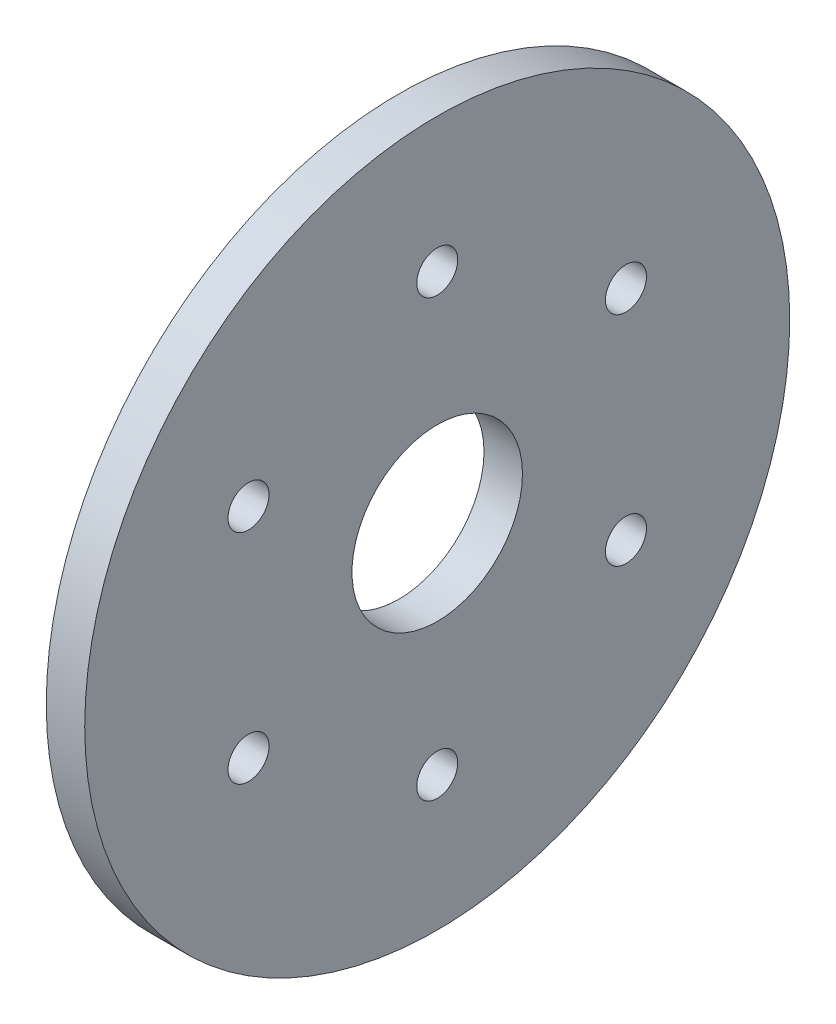
ISO-10303-21;
HEADER;
FILE_DESCRIPTION(('STEP AP214'),'2;1');
FILE_NAME('part.step','',(''),(''),'','','');
FILE_SCHEMA(('AUTOMOTIVE_DESIGN { 1 0 10303 214 1 1 1 1 }'));
ENDSEC;
DATA;
#1=APPLICATION_CONTEXT('core data for automotive mechanical design processes');
#2=APPLICATION_PROTOCOL_DEFINITION('international standard','automotive_design',2000,#1);
#3=PRODUCT_CONTEXT('',#1,'mechanical');
#4=PRODUCT('Part','Part','',(#3));
#5=PRODUCT_RELATED_PRODUCT_CATEGORY('part','',(#4));
#6=PRODUCT_DEFINITION_FORMATION('','',#4);
#7=PRODUCT_DEFINITION_CONTEXT('part definition',#1,'design');
#8=PRODUCT_DEFINITION('design','',#6,#7);
#9=PRODUCT_DEFINITION_SHAPE('','',#8);
#10=(LENGTH_UNIT() NAMED_UNIT(*) SI_UNIT(.MILLI.,.METRE.));
#11=(NAMED_UNIT(*) PLANE_ANGLE_UNIT() SI_UNIT($,.RADIAN.));
#12=(NAMED_UNIT(*) SI_UNIT($,.STERADIAN.) SOLID_ANGLE_UNIT());
#13=UNCERTAINTY_MEASURE_WITH_UNIT(LENGTH_MEASURE(1.E-05),#10,'distance_accuracy_value','');
#14=(GEOMETRIC_REPRESENTATION_CONTEXT(3) GLOBAL_UNCERTAINTY_ASSIGNED_CONTEXT((#13)) GLOBAL_UNIT_ASSIGNED_CONTEXT((#10,
#11,#12)) REPRESENTATION_CONTEXT('',''));
#15=CARTESIAN_POINT('',(0.,0.,0.));
#16=DIRECTION('',(0.,0.,1.));
#17=DIRECTION('',(1.,0.,0.));
#18=AXIS2_PLACEMENT_3D('',#15,#16,#17);
#19=CARTESIAN_POINT('',(3.,0.,0.));
#20=DIRECTION('',(1.,0.,0.));
#21=DIRECTION('',(0.,0.,-1.));
#22=AXIS2_PLACEMENT_3D('',#19,#20,#21);
#23=PLANE('',#22);
#24=CARTESIAN_POINT('',(3.,8.50000000000084,-14.7224318643359));
#25=DIRECTION('',(1.,0.,0.));
#26=DIRECTION('',(0.,0.,-1.));
#27=AXIS2_PLACEMENT_3D('',#24,#25,#26);
#28=CIRCLE('',#27,1.60000000000026);
#29=CARTESIAN_POINT('',(3.,8.50000000000084,-16.3224318643362));
#30=VERTEX_POINT('',#29);
#31=EDGE_CURVE('E79',#30,#30,#28,.T.);
#32=ORIENTED_EDGE('',*,*,#31,.F.);
#33=EDGE_LOOP('',(#32));
#34=FACE_BOUND('',#33,.T.);
#35=CARTESIAN_POINT('',(3.,-8.49999999999916,-14.7224318643369));
#36=DIRECTION('',(1.,0.,0.));
#37=DIRECTION('',(0.,0.,-1.));
#38=AXIS2_PLACEMENT_3D('',#35,#36,#37);
#39=CIRCLE('',#38,1.60000000000122);
#40=CARTESIAN_POINT('',(3.,-8.49999999999916,-16.3224318643381));
#41=VERTEX_POINT('',#40);
#42=EDGE_CURVE('E73',#41,#41,#39,.T.);
#43=ORIENTED_EDGE('',*,*,#42,.F.);
#44=EDGE_LOOP('',(#43));
#45=FACE_BOUND('',#44,.T.);
#46=CARTESIAN_POINT('',(3.,-17.,-1.92851244215037E-12));
#47=DIRECTION('',(1.,0.,0.));
#48=DIRECTION('',(0.,0.,-1.));
#49=AXIS2_PLACEMENT_3D('',#46,#47,#48);
#50=CIRCLE('',#49,1.60000000000196);
#51=CARTESIAN_POINT('',(3.,-17.,-1.60000000000389));
#52=VERTEX_POINT('',#51);
#53=EDGE_CURVE('E67',#52,#52,#50,.T.);
#54=ORIENTED_EDGE('',*,*,#53,.F.);
#55=EDGE_LOOP('',(#54));
#56=FACE_BOUND('',#55,.T.);
#57=CARTESIAN_POINT('',(3.,-8.50000000000084,14.722431864334));
#58=DIRECTION('',(1.,0.,0.));
#59=DIRECTION('',(0.,0.,-1.));
#60=AXIS2_PLACEMENT_3D('',#57,#58,#59);
#61=CIRCLE('',#60,1.60000000000178);
#62=CARTESIAN_POINT('',(3.,-8.50000000000084,13.1224318643322));
#63=VERTEX_POINT('',#62);
#64=EDGE_CURVE('E61',#63,#63,#61,.T.);
#65=ORIENTED_EDGE('',*,*,#64,.F.);
#66=EDGE_LOOP('',(#65));
#67=FACE_BOUND('',#66,.T.);
#68=CARTESIAN_POINT('',(3.,8.49999999999915,14.722431864335));
#69=DIRECTION('',(1.,0.,0.));
#70=DIRECTION('',(0.,0.,-1.));
#71=AXIS2_PLACEMENT_3D('',#68,#69,#70);
#72=CIRCLE('',#71,1.60000000000091);
#73=CARTESIAN_POINT('',(3.,8.49999999999915,13.1224318643341));
#74=VERTEX_POINT('',#73);
#75=EDGE_CURVE('E55',#74,#74,#72,.T.);
#76=ORIENTED_EDGE('',*,*,#75,.F.);
#77=EDGE_LOOP('',(#76));
#78=FACE_BOUND('',#77,.T.);
#79=CARTESIAN_POINT('',(3.,17.,0.));
#80=DIRECTION('',(1.,0.,0.));
#81=DIRECTION('',(0.,0.,-1.));
#82=AXIS2_PLACEMENT_3D('',#79,#80,#81);
#83=CIRCLE('',#82,1.6);
#84=CARTESIAN_POINT('',(3.,17.,-1.6));
#85=VERTEX_POINT('',#84);
#86=EDGE_CURVE('E49',#85,#85,#83,.T.);
#87=ORIENTED_EDGE('',*,*,#86,.F.);
#88=EDGE_LOOP('',(#87));
#89=FACE_BOUND('',#88,.T.);
#90=CARTESIAN_POINT('',(3.,0.,0.));
#91=DIRECTION('',(1.,0.,0.));
#92=DIRECTION('',(0.,0.,-1.));
#93=AXIS2_PLACEMENT_3D('',#90,#91,#92);
#94=CIRCLE('',#93,27.5);
#95=CARTESIAN_POINT('',(3.,0.,-27.5));
#96=VERTEX_POINT('',#95);
#97=EDGE_CURVE('E10',#96,#96,#94,.T.);
#98=ORIENTED_EDGE('',*,*,#97,.T.);
#99=EDGE_LOOP('',(#98));
#100=FACE_BOUND('',#99,.T.);
#101=CARTESIAN_POINT('',(3.,0.,0.));
#102=DIRECTION('',(1.,0.,0.));
#103=DIRECTION('',(0.,0.,-1.));
#104=AXIS2_PLACEMENT_3D('',#101,#102,#103);
#105=CIRCLE('',#104,6.65);
#106=CARTESIAN_POINT('',(3.,0.,-6.65));
#107=VERTEX_POINT('',#106);
#108=EDGE_CURVE('E41',#107,#107,#105,.T.);
#109=ORIENTED_EDGE('',*,*,#108,.F.);
#110=EDGE_LOOP('',(#109));
#111=FACE_BOUND('',#110,.T.);
#112=ADVANCED_FACE('F30',(#34,#45,#56,#67,#78,#89,#100,#111),#23,.T.);
#113=CARTESIAN_POINT('',(0.,0.,0.));
#114=DIRECTION('',(1.,0.,0.));
#115=DIRECTION('',(0.,0.,-1.));
#116=AXIS2_PLACEMENT_3D('',#113,#114,#115);
#117=PLANE('',#116);
#118=CARTESIAN_POINT('',(0.,8.50000000000084,-14.7224318643359));
#119=DIRECTION('',(1.,0.,0.));
#120=DIRECTION('',(0.,0.,-1.));
#121=AXIS2_PLACEMENT_3D('',#118,#119,#120);
#122=CIRCLE('',#121,1.60000000000026);
#123=CARTESIAN_POINT('',(0.,8.50000000000084,-16.3224318643362));
#124=VERTEX_POINT('',#123);
#125=EDGE_CURVE('E52',#124,#124,#122,.T.);
#126=ORIENTED_EDGE('',*,*,#125,.T.);
#127=EDGE_LOOP('',(#126));
#128=FACE_BOUND('',#127,.T.);
#129=CARTESIAN_POINT('',(0.,-8.49999999999916,-14.7224318643369));
#130=DIRECTION('',(1.,0.,0.));
#131=DIRECTION('',(0.,0.,-1.));
#132=AXIS2_PLACEMENT_3D('',#129,#130,#131);
#133=CIRCLE('',#132,1.60000000000122);
#134=CARTESIAN_POINT('',(0.,-8.49999999999916,-16.3224318643381));
#135=VERTEX_POINT('',#134);
#136=EDGE_CURVE('E76',#135,#135,#133,.T.);
#137=ORIENTED_EDGE('',*,*,#136,.T.);
#138=EDGE_LOOP('',(#137));
#139=FACE_BOUND('',#138,.T.);
#140=CARTESIAN_POINT('',(0.,-17.,-1.92851244215037E-12));
#141=DIRECTION('',(1.,0.,0.));
#142=DIRECTION('',(0.,0.,-1.));
#143=AXIS2_PLACEMENT_3D('',#140,#141,#142);
#144=CIRCLE('',#143,1.60000000000196);
#145=CARTESIAN_POINT('',(0.,-17.,-1.60000000000389));
#146=VERTEX_POINT('',#145);
#147=EDGE_CURVE('E70',#146,#146,#144,.T.);
#148=ORIENTED_EDGE('',*,*,#147,.T.);
#149=EDGE_LOOP('',(#148));
#150=FACE_BOUND('',#149,.T.);
#151=CARTESIAN_POINT('',(0.,-8.50000000000084,14.722431864334));
#152=DIRECTION('',(1.,0.,0.));
#153=DIRECTION('',(0.,0.,-1.));
#154=AXIS2_PLACEMENT_3D('',#151,#152,#153);
#155=CIRCLE('',#154,1.60000000000178);
#156=CARTESIAN_POINT('',(0.,-8.50000000000084,13.1224318643322));
#157=VERTEX_POINT('',#156);
#158=EDGE_CURVE('E64',#157,#157,#155,.T.);
#159=ORIENTED_EDGE('',*,*,#158,.T.);
#160=EDGE_LOOP('',(#159));
#161=FACE_BOUND('',#160,.T.);
#162=CARTESIAN_POINT('',(0.,8.49999999999915,14.722431864335));
#163=DIRECTION('',(1.,0.,0.));
#164=DIRECTION('',(0.,0.,-1.));
#165=AXIS2_PLACEMENT_3D('',#162,#163,#164);
#166=CIRCLE('',#165,1.60000000000091);
#167=CARTESIAN_POINT('',(0.,8.49999999999915,13.1224318643341));
#168=VERTEX_POINT('',#167);
#169=EDGE_CURVE('E58',#168,#168,#166,.T.);
#170=ORIENTED_EDGE('',*,*,#169,.T.);
#171=EDGE_LOOP('',(#170));
#172=FACE_BOUND('',#171,.T.);
#173=CARTESIAN_POINT('',(0.,17.,0.));
#174=DIRECTION('',(1.,0.,0.));
#175=DIRECTION('',(0.,0.,-1.));
#176=AXIS2_PLACEMENT_3D('',#173,#174,#175);
#177=CIRCLE('',#176,1.6);
#178=CARTESIAN_POINT('',(0.,17.,-1.6));
#179=VERTEX_POINT('',#178);
#180=EDGE_CURVE('E46',#179,#179,#177,.T.);
#181=ORIENTED_EDGE('',*,*,#180,.T.);
#182=EDGE_LOOP('',(#181));
#183=FACE_BOUND('',#182,.T.);
#184=CARTESIAN_POINT('',(0.,0.,0.));
#185=DIRECTION('',(1.,0.,0.));
#186=DIRECTION('',(0.,0.,-1.));
#187=AXIS2_PLACEMENT_3D('',#184,#185,#186);
#188=CIRCLE('',#187,27.5);
#189=CARTESIAN_POINT('',(0.,0.,-27.5));
#190=VERTEX_POINT('',#189);
#191=EDGE_CURVE('E34',#190,#190,#188,.T.);
#192=ORIENTED_EDGE('',*,*,#191,.F.);
#193=EDGE_LOOP('',(#192));
#194=FACE_BOUND('',#193,.T.);
#195=CARTESIAN_POINT('',(0.,0.,0.));
#196=DIRECTION('',(1.,0.,0.));
#197=DIRECTION('',(0.,0.,-1.));
#198=AXIS2_PLACEMENT_3D('',#195,#196,#197);
#199=CIRCLE('',#198,6.65);
#200=CARTESIAN_POINT('',(0.,0.,-6.65));
#201=VERTEX_POINT('',#200);
#202=EDGE_CURVE('E43',#201,#201,#199,.T.);
#203=ORIENTED_EDGE('',*,*,#202,.T.);
#204=EDGE_LOOP('',(#203));
#205=FACE_BOUND('',#204,.T.);
#206=ADVANCED_FACE('F85',(#128,#139,#150,#161,#172,#183,#194,#205),#117,.F.);
#207=CARTESIAN_POINT('',(3.,0.,0.));
#208=DIRECTION('',(-1.,0.,0.));
#209=DIRECTION('',(0.,0.,1.));
#210=AXIS2_PLACEMENT_3D('',#207,#208,#209);
#211=CYLINDRICAL_SURFACE('',#210,27.5);
#212=ORIENTED_EDGE('',*,*,#97,.F.);
#213=EDGE_LOOP('',(#212));
#214=FACE_BOUND('',#213,.T.);
#215=ORIENTED_EDGE('',*,*,#191,.T.);
#216=EDGE_LOOP('',(#215));
#217=FACE_BOUND('',#216,.T.);
#218=ADVANCED_FACE('F32',(#214,#217),#211,.T.);
#219=CARTESIAN_POINT('',(3.,0.,0.));
#220=DIRECTION('',(-1.,0.,0.));
#221=DIRECTION('',(0.,0.,1.));
#222=AXIS2_PLACEMENT_3D('',#219,#220,#221);
#223=CYLINDRICAL_SURFACE('',#222,6.65);
#224=ORIENTED_EDGE('',*,*,#108,.T.);
#225=EDGE_LOOP('',(#224));
#226=FACE_BOUND('',#225,.T.);
#227=ORIENTED_EDGE('',*,*,#202,.F.);
#228=EDGE_LOOP('',(#227));
#229=FACE_BOUND('',#228,.T.);
#230=ADVANCED_FACE('F110',(#226,#229),#223,.F.);
#231=CARTESIAN_POINT('',(0.,17.,0.));
#232=DIRECTION('',(1.,0.,0.));
#233=DIRECTION('',(0.,0.,-1.));
#234=AXIS2_PLACEMENT_3D('',#231,#232,#233);
#235=CYLINDRICAL_SURFACE('',#234,1.6);
#236=ORIENTED_EDGE('',*,*,#180,.F.);
#237=EDGE_LOOP('',(#236));
#238=FACE_BOUND('',#237,.T.);
#239=ORIENTED_EDGE('',*,*,#86,.T.);
#240=EDGE_LOOP('',(#239));
#241=FACE_BOUND('',#240,.T.);
#242=ADVANCED_FACE('F113',(#238,#241),#235,.F.);
#243=CARTESIAN_POINT('',(0.,8.49999999999915,14.722431864335));
#244=DIRECTION('',(1.,0.,0.));
#245=DIRECTION('',(0.,0.,-1.));
#246=AXIS2_PLACEMENT_3D('',#243,#244,#245);
#247=CYLINDRICAL_SURFACE('',#246,1.60000000000091);
#248=ORIENTED_EDGE('',*,*,#169,.F.);
#249=EDGE_LOOP('',(#248));
#250=FACE_BOUND('',#249,.T.);
#251=ORIENTED_EDGE('',*,*,#75,.T.);
#252=EDGE_LOOP('',(#251));
#253=FACE_BOUND('',#252,.T.);
#254=ADVANCED_FACE('F125',(#250,#253),#247,.F.);
#255=CARTESIAN_POINT('',(0.,-8.50000000000084,14.722431864334));
#256=DIRECTION('',(1.,0.,0.));
#257=DIRECTION('',(0.,0.,-1.));
#258=AXIS2_PLACEMENT_3D('',#255,#256,#257);
#259=CYLINDRICAL_SURFACE('',#258,1.60000000000178);
#260=ORIENTED_EDGE('',*,*,#158,.F.);
#261=EDGE_LOOP('',(#260));
#262=FACE_BOUND('',#261,.T.);
#263=ORIENTED_EDGE('',*,*,#64,.T.);
#264=EDGE_LOOP('',(#263));
#265=FACE_BOUND('',#264,.T.);
#266=ADVANCED_FACE('F129',(#262,#265),#259,.F.);
#267=CARTESIAN_POINT('',(0.,-17.,-1.92851244215037E-12));
#268=DIRECTION('',(1.,0.,0.));
#269=DIRECTION('',(0.,0.,-1.));
#270=AXIS2_PLACEMENT_3D('',#267,#268,#269);
#271=CYLINDRICAL_SURFACE('',#270,1.60000000000196);
#272=ORIENTED_EDGE('',*,*,#147,.F.);
#273=EDGE_LOOP('',(#272));
#274=FACE_BOUND('',#273,.T.);
#275=ORIENTED_EDGE('',*,*,#53,.T.);
#276=EDGE_LOOP('',(#275));
#277=FACE_BOUND('',#276,.T.);
#278=ADVANCED_FACE('F133',(#274,#277),#271,.F.);
#279=CARTESIAN_POINT('',(0.,-8.49999999999916,-14.7224318643369));
#280=DIRECTION('',(1.,0.,0.));
#281=DIRECTION('',(0.,0.,-1.));
#282=AXIS2_PLACEMENT_3D('',#279,#280,#281);
#283=CYLINDRICAL_SURFACE('',#282,1.60000000000122);
#284=ORIENTED_EDGE('',*,*,#136,.F.);
#285=EDGE_LOOP('',(#284));
#286=FACE_BOUND('',#285,.T.);
#287=ORIENTED_EDGE('',*,*,#42,.T.);
#288=EDGE_LOOP('',(#287));
#289=FACE_BOUND('',#288,.T.);
#290=ADVANCED_FACE('F91',(#286,#289),#283,.F.);
#291=CARTESIAN_POINT('',(0.,8.50000000000084,-14.7224318643359));
#292=DIRECTION('',(1.,0.,0.));
#293=DIRECTION('',(0.,0.,-1.));
#294=AXIS2_PLACEMENT_3D('',#291,#292,#293);
#295=CYLINDRICAL_SURFACE('',#294,1.60000000000026);
#296=ORIENTED_EDGE('',*,*,#125,.F.);
#297=EDGE_LOOP('',(#296));
#298=FACE_BOUND('',#297,.T.);
#299=ORIENTED_EDGE('',*,*,#31,.T.);
#300=EDGE_LOOP('',(#299));
#301=FACE_BOUND('',#300,.T.);
#302=ADVANCED_FACE('F88',(#298,#301),#295,.F.);
#303=CLOSED_SHELL('',(#112,#206,#218,#230,#242,#254,#266,#278,#290,#302));
#304=MANIFOLD_SOLID_BREP('B2',#303);
#305=ADVANCED_BREP_SHAPE_REPRESENTATION('',(#18,#304),#14);
#306=SHAPE_DEFINITION_REPRESENTATION(#9,#305);
ENDSEC;
END-ISO-10303-21;
